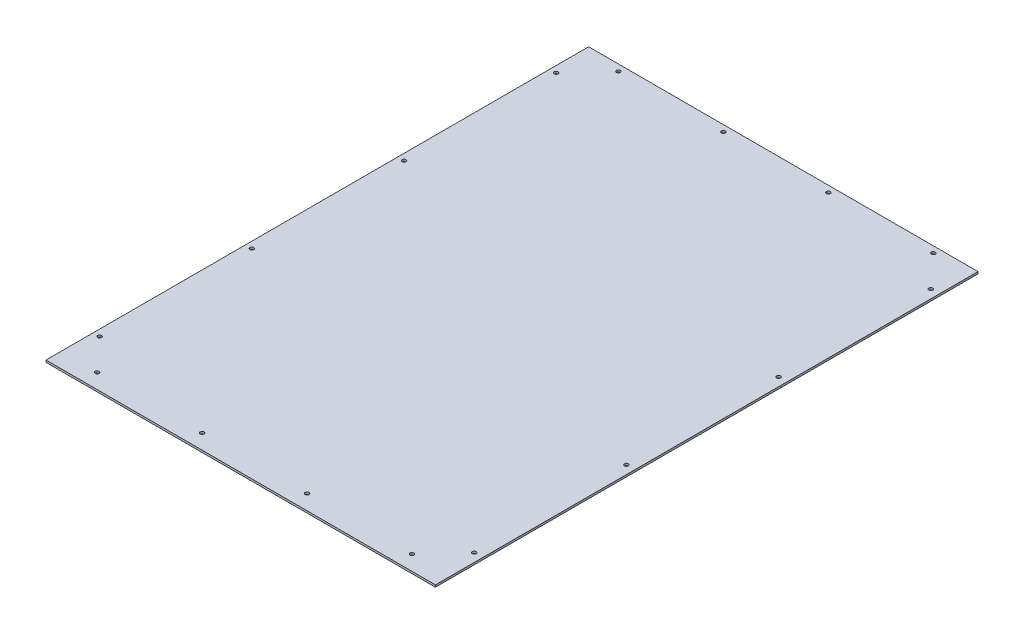
ISO-10303-21;
HEADER;
FILE_DESCRIPTION(('STEP AP214'),'2;1');
FILE_NAME('part.step','',(''),(''),'','','');
FILE_SCHEMA(('AUTOMOTIVE_DESIGN { 1 0 10303 214 1 1 1 1 }'));
ENDSEC;
DATA;
#1=APPLICATION_CONTEXT('core data for automotive mechanical design processes');
#2=APPLICATION_PROTOCOL_DEFINITION('international standard','automotive_design',2000,#1);
#3=PRODUCT_CONTEXT('',#1,'mechanical');
#4=PRODUCT('Part','Part','',(#3));
#5=PRODUCT_RELATED_PRODUCT_CATEGORY('part','',(#4));
#6=PRODUCT_DEFINITION_FORMATION('','',#4);
#7=PRODUCT_DEFINITION_CONTEXT('part definition',#1,'design');
#8=PRODUCT_DEFINITION('design','',#6,#7);
#9=PRODUCT_DEFINITION_SHAPE('','',#8);
#10=(LENGTH_UNIT() NAMED_UNIT(*) SI_UNIT(.MILLI.,.METRE.));
#11=(NAMED_UNIT(*) PLANE_ANGLE_UNIT() SI_UNIT($,.RADIAN.));
#12=(NAMED_UNIT(*) SI_UNIT($,.STERADIAN.) SOLID_ANGLE_UNIT());
#13=UNCERTAINTY_MEASURE_WITH_UNIT(LENGTH_MEASURE(1.E-05),#10,'distance_accuracy_value','');
#14=(GEOMETRIC_REPRESENTATION_CONTEXT(3) GLOBAL_UNCERTAINTY_ASSIGNED_CONTEXT((#13)) GLOBAL_UNIT_ASSIGNED_CONTEXT((#10,
#11,#12)) REPRESENTATION_CONTEXT('',''));
#15=CARTESIAN_POINT('',(0.,0.,0.));
#16=DIRECTION('',(0.,0.,1.));
#17=DIRECTION('',(1.,0.,0.));
#18=AXIS2_PLACEMENT_3D('',#15,#16,#17);
#19=CARTESIAN_POINT('',(9.525,0.,-70.5865999999999));
#20=DIRECTION('',(0.,1.,0.));
#21=DIRECTION('',(0.,0.,1.));
#22=AXIS2_PLACEMENT_3D('',#19,#20,#21);
#23=CYLINDRICAL_SURFACE('',#22,2.89559999999984);
#24=CARTESIAN_POINT('',(9.525,0.,-70.5865999999999));
#25=DIRECTION('',(0.,1.,0.));
#26=DIRECTION('',(0.,0.,1.));
#27=AXIS2_PLACEMENT_3D('',#24,#25,#26);
#28=CIRCLE('',#27,2.89559999999984);
#29=CARTESIAN_POINT('',(9.525,0.,-67.691));
#30=VERTEX_POINT('',#29);
#31=EDGE_CURVE('E44',#30,#30,#28,.T.);
#32=ORIENTED_EDGE('',*,*,#31,.F.);
#33=EDGE_LOOP('',(#32));
#34=FACE_BOUND('',#33,.T.);
#35=CARTESIAN_POINT('',(9.525,3.0734,-70.5865999999999));
#36=DIRECTION('',(0.,1.,0.));
#37=DIRECTION('',(0.,0.,1.));
#38=AXIS2_PLACEMENT_3D('',#35,#36,#37);
#39=CIRCLE('',#38,2.89559999999984);
#40=CARTESIAN_POINT('',(9.525,3.0734,-67.691));
#41=VERTEX_POINT('',#40);
#42=EDGE_CURVE('E12',#41,#41,#39,.T.);
#43=ORIENTED_EDGE('',*,*,#42,.T.);
#44=EDGE_LOOP('',(#43));
#45=FACE_BOUND('',#44,.T.);
#46=ADVANCED_FACE('F38',(#34,#45),#23,.F.);
#47=CARTESIAN_POINT('',(9.525,0.,-297.671066666666));
#48=DIRECTION('',(0.,1.,0.));
#49=DIRECTION('',(0.,0.,1.));
#50=AXIS2_PLACEMENT_3D('',#47,#48,#49);
#51=CYLINDRICAL_SURFACE('',#50,2.89559999999984);
#52=CARTESIAN_POINT('',(9.525,0.,-297.671066666666));
#53=DIRECTION('',(0.,1.,0.));
#54=DIRECTION('',(0.,0.,1.));
#55=AXIS2_PLACEMENT_3D('',#52,#53,#54);
#56=CIRCLE('',#55,2.89559999999984);
#57=CARTESIAN_POINT('',(9.525,0.,-294.775466666667));
#58=VERTEX_POINT('',#57);
#59=EDGE_CURVE('E344',#58,#58,#56,.T.);
#60=ORIENTED_EDGE('',*,*,#59,.F.);
#61=EDGE_LOOP('',(#60));
#62=FACE_BOUND('',#61,.T.);
#63=CARTESIAN_POINT('',(9.525,3.0734,-297.671066666666));
#64=DIRECTION('',(0.,1.,0.));
#65=DIRECTION('',(0.,0.,1.));
#66=AXIS2_PLACEMENT_3D('',#63,#64,#65);
#67=CIRCLE('',#66,2.89559999999984);
#68=CARTESIAN_POINT('',(9.525,3.0734,-294.775466666667));
#69=VERTEX_POINT('',#68);
#70=EDGE_CURVE('E349',#69,#69,#67,.T.);
#71=ORIENTED_EDGE('',*,*,#70,.T.);
#72=EDGE_LOOP('',(#71));
#73=FACE_BOUND('',#72,.T.);
#74=ADVANCED_FACE('F360',(#62,#73),#51,.F.);
#75=CARTESIAN_POINT('',(568.5282,0.,-70.5865999999999));
#76=DIRECTION('',(0.,1.,0.));
#77=DIRECTION('',(0.,0.,1.));
#78=AXIS2_PLACEMENT_3D('',#75,#76,#77);
#79=CYLINDRICAL_SURFACE('',#78,2.89559999999998);
#80=CARTESIAN_POINT('',(568.5282,0.,-70.5865999999999));
#81=DIRECTION('',(0.,1.,0.));
#82=DIRECTION('',(0.,0.,1.));
#83=AXIS2_PLACEMENT_3D('',#80,#81,#82);
#84=CIRCLE('',#83,2.89559999999998);
#85=CARTESIAN_POINT('',(568.5282,0.,-67.6909999999999));
#86=VERTEX_POINT('',#85);
#87=EDGE_CURVE('E337',#86,#86,#84,.T.);
#88=ORIENTED_EDGE('',*,*,#87,.F.);
#89=EDGE_LOOP('',(#88));
#90=FACE_BOUND('',#89,.T.);
#91=CARTESIAN_POINT('',(568.5282,3.0734,-70.5865999999999));
#92=DIRECTION('',(0.,1.,0.));
#93=DIRECTION('',(0.,0.,1.));
#94=AXIS2_PLACEMENT_3D('',#91,#92,#93);
#95=CIRCLE('',#94,2.89559999999998);
#96=CARTESIAN_POINT('',(568.5282,3.0734,-67.6909999999999));
#97=VERTEX_POINT('',#96);
#98=EDGE_CURVE('E342',#97,#97,#95,.T.);
#99=ORIENTED_EDGE('',*,*,#98,.T.);
#100=EDGE_LOOP('',(#99));
#101=FACE_BOUND('',#100,.T.);
#102=ADVANCED_FACE('F411',(#90,#101),#79,.F.);
#103=CARTESIAN_POINT('',(568.5282,0.,-297.671066666666));
#104=DIRECTION('',(0.,1.,0.));
#105=DIRECTION('',(0.,0.,1.));
#106=AXIS2_PLACEMENT_3D('',#103,#104,#105);
#107=CYLINDRICAL_SURFACE('',#106,2.89559999999998);
#108=CARTESIAN_POINT('',(568.5282,0.,-297.671066666666));
#109=DIRECTION('',(0.,1.,0.));
#110=DIRECTION('',(0.,0.,1.));
#111=AXIS2_PLACEMENT_3D('',#108,#109,#110);
#112=CIRCLE('',#111,2.89559999999998);
#113=CARTESIAN_POINT('',(568.5282,0.,-294.775466666666));
#114=VERTEX_POINT('',#113);
#115=EDGE_CURVE('E329',#114,#114,#112,.T.);
#116=ORIENTED_EDGE('',*,*,#115,.F.);
#117=EDGE_LOOP('',(#116));
#118=FACE_BOUND('',#117,.T.);
#119=CARTESIAN_POINT('',(568.5282,3.0734,-297.671066666666));
#120=DIRECTION('',(0.,1.,0.));
#121=DIRECTION('',(0.,0.,1.));
#122=AXIS2_PLACEMENT_3D('',#119,#120,#121);
#123=CIRCLE('',#122,2.89559999999998);
#124=CARTESIAN_POINT('',(568.5282,3.0734,-294.775466666666));
#125=VERTEX_POINT('',#124);
#126=EDGE_CURVE('E334',#125,#125,#123,.T.);
#127=ORIENTED_EDGE('',*,*,#126,.T.);
#128=EDGE_LOOP('',(#127));
#129=FACE_BOUND('',#128,.T.);
#130=ADVANCED_FACE('F407',(#118,#129),#107,.F.);
#131=CARTESIAN_POINT('',(523.9766,0.,-800.2016));
#132=DIRECTION('',(0.,1.,0.));
#133=DIRECTION('',(0.,0.,1.));
#134=AXIS2_PLACEMENT_3D('',#131,#132,#133);
#135=CYLINDRICAL_SURFACE('',#134,2.89559999999997);
#136=CARTESIAN_POINT('',(523.9766,0.,-800.2016));
#137=DIRECTION('',(0.,1.,0.));
#138=DIRECTION('',(0.,0.,1.));
#139=AXIS2_PLACEMENT_3D('',#136,#137,#138);
#140=CIRCLE('',#139,2.89559999999997);
#141=CARTESIAN_POINT('',(523.9766,0.,-797.306));
#142=VERTEX_POINT('',#141);
#143=EDGE_CURVE('E322',#142,#142,#140,.T.);
#144=ORIENTED_EDGE('',*,*,#143,.F.);
#145=EDGE_LOOP('',(#144));
#146=FACE_BOUND('',#145,.T.);
#147=CARTESIAN_POINT('',(523.9766,3.0734,-800.2016));
#148=DIRECTION('',(0.,1.,0.));
#149=DIRECTION('',(0.,0.,1.));
#150=AXIS2_PLACEMENT_3D('',#147,#148,#149);
#151=CIRCLE('',#150,2.89559999999997);
#152=CARTESIAN_POINT('',(523.9766,3.0734,-797.306));
#153=VERTEX_POINT('',#152);
#154=EDGE_CURVE('E327',#153,#153,#151,.T.);
#155=ORIENTED_EDGE('',*,*,#154,.T.);
#156=EDGE_LOOP('',(#155));
#157=FACE_BOUND('',#156,.T.);
#158=ADVANCED_FACE('F403',(#146,#157),#135,.F.);
#159=CARTESIAN_POINT('',(367.343266666667,0.,-800.2016));
#160=DIRECTION('',(0.,1.,0.));
#161=DIRECTION('',(0.,0.,1.));
#162=AXIS2_PLACEMENT_3D('',#159,#160,#161);
#163=CYLINDRICAL_SURFACE('',#162,2.89559999999997);
#164=CARTESIAN_POINT('',(367.343266666667,0.,-800.2016));
#165=DIRECTION('',(0.,1.,0.));
#166=DIRECTION('',(0.,0.,1.));
#167=AXIS2_PLACEMENT_3D('',#164,#165,#166);
#168=CIRCLE('',#167,2.89559999999997);
#169=CARTESIAN_POINT('',(367.343266666667,0.,-797.306));
#170=VERTEX_POINT('',#169);
#171=EDGE_CURVE('E311',#170,#170,#168,.T.);
#172=ORIENTED_EDGE('',*,*,#171,.F.);
#173=EDGE_LOOP('',(#172));
#174=FACE_BOUND('',#173,.T.);
#175=CARTESIAN_POINT('',(367.343266666667,3.0734,-800.2016));
#176=DIRECTION('',(0.,1.,0.));
#177=DIRECTION('',(0.,0.,1.));
#178=AXIS2_PLACEMENT_3D('',#175,#176,#177);
#179=CIRCLE('',#178,2.89559999999997);
#180=CARTESIAN_POINT('',(367.343266666667,3.0734,-797.306));
#181=VERTEX_POINT('',#180);
#182=EDGE_CURVE('E316',#181,#181,#179,.T.);
#183=ORIENTED_EDGE('',*,*,#182,.T.);
#184=EDGE_LOOP('',(#183));
#185=FACE_BOUND('',#184,.T.);
#186=ADVANCED_FACE('F399',(#174,#185),#163,.F.);
#187=CARTESIAN_POINT('',(523.9766,0.,-22.225));
#188=DIRECTION('',(0.,1.,0.));
#189=DIRECTION('',(0.,0.,1.));
#190=AXIS2_PLACEMENT_3D('',#187,#188,#189);
#191=CYLINDRICAL_SURFACE('',#190,2.89559999999999);
#192=CARTESIAN_POINT('',(523.9766,0.,-22.225));
#193=DIRECTION('',(0.,1.,0.));
#194=DIRECTION('',(0.,0.,1.));
#195=AXIS2_PLACEMENT_3D('',#192,#193,#194);
#196=CIRCLE('',#195,2.89559999999999);
#197=CARTESIAN_POINT('',(523.9766,0.,-19.3294));
#198=VERTEX_POINT('',#197);
#199=EDGE_CURVE('E303',#198,#198,#196,.T.);
#200=ORIENTED_EDGE('',*,*,#199,.F.);
#201=EDGE_LOOP('',(#200));
#202=FACE_BOUND('',#201,.T.);
#203=CARTESIAN_POINT('',(523.9766,3.0734,-22.225));
#204=DIRECTION('',(0.,1.,0.));
#205=DIRECTION('',(0.,0.,1.));
#206=AXIS2_PLACEMENT_3D('',#203,#204,#205);
#207=CIRCLE('',#206,2.89559999999999);
#208=CARTESIAN_POINT('',(523.9766,3.0734,-19.3294));
#209=VERTEX_POINT('',#208);
#210=EDGE_CURVE('E308',#209,#209,#207,.T.);
#211=ORIENTED_EDGE('',*,*,#210,.T.);
#212=EDGE_LOOP('',(#211));
#213=FACE_BOUND('',#212,.T.);
#214=ADVANCED_FACE('F395',(#202,#213),#191,.F.);
#215=CARTESIAN_POINT('',(367.343266666667,0.,-22.225));
#216=DIRECTION('',(0.,1.,0.));
#217=DIRECTION('',(0.,0.,1.));
#218=AXIS2_PLACEMENT_3D('',#215,#216,#217);
#219=CYLINDRICAL_SURFACE('',#218,2.89559999999999);
#220=CARTESIAN_POINT('',(367.343266666667,0.,-22.225));
#221=DIRECTION('',(0.,1.,0.));
#222=DIRECTION('',(0.,0.,1.));
#223=AXIS2_PLACEMENT_3D('',#220,#221,#222);
#224=CIRCLE('',#223,2.89559999999999);
#225=CARTESIAN_POINT('',(367.343266666667,0.,-19.3294));
#226=VERTEX_POINT('',#225);
#227=EDGE_CURVE('E293',#226,#226,#224,.T.);
#228=ORIENTED_EDGE('',*,*,#227,.F.);
#229=EDGE_LOOP('',(#228));
#230=FACE_BOUND('',#229,.T.);
#231=CARTESIAN_POINT('',(367.343266666667,3.0734,-22.225));
#232=DIRECTION('',(0.,1.,0.));
#233=DIRECTION('',(0.,0.,1.));
#234=AXIS2_PLACEMENT_3D('',#231,#232,#233);
#235=CIRCLE('',#234,2.89559999999999);
#236=CARTESIAN_POINT('',(367.343266666667,3.0734,-19.3294));
#237=VERTEX_POINT('',#236);
#238=EDGE_CURVE('E299',#237,#237,#235,.T.);
#239=ORIENTED_EDGE('',*,*,#238,.T.);
#240=EDGE_LOOP('',(#239));
#241=FACE_BOUND('',#240,.T.);
#242=ADVANCED_FACE('F391',(#230,#241),#219,.F.);
#243=CARTESIAN_POINT('',(0.,3.0734,0.));
#244=DIRECTION('',(1.,0.,0.));
#245=DIRECTION('',(0.,0.,-1.));
#246=AXIS2_PLACEMENT_3D('',#243,#244,#245);
#247=PLANE('',#246);
#248=DIRECTION('',(0.,0.,1.));
#249=VECTOR('',#248,1.);
#250=CARTESIAN_POINT('',(0.,0.,0.));
#251=LINE('',#250,#249);
#252=CARTESIAN_POINT('',(0.,0.,-809.7266));
#253=VERTEX_POINT('',#252);
#254=CARTESIAN_POINT('',(0.,0.,0.));
#255=VERTEX_POINT('',#254);
#256=EDGE_CURVE('E266',#253,#255,#251,.T.);
#257=ORIENTED_EDGE('',*,*,#256,.T.);
#258=DIRECTION('',(0.,-1.,0.));
#259=VECTOR('',#258,1.);
#260=CARTESIAN_POINT('',(0.,3.0734,0.));
#261=LINE('',#260,#259);
#262=CARTESIAN_POINT('',(0.,3.0734,0.));
#263=VERTEX_POINT('',#262);
#264=EDGE_CURVE('E300',#263,#255,#261,.T.);
#265=ORIENTED_EDGE('',*,*,#264,.F.);
#266=DIRECTION('',(0.,0.,1.));
#267=VECTOR('',#266,1.);
#268=CARTESIAN_POINT('',(0.,3.0734,0.));
#269=LINE('',#268,#267);
#270=CARTESIAN_POINT('',(0.,3.0734,-809.7266));
#271=VERTEX_POINT('',#270);
#272=EDGE_CURVE('E269',#271,#263,#269,.T.);
#273=ORIENTED_EDGE('',*,*,#272,.F.);
#274=DIRECTION('',(0.,-1.,0.));
#275=VECTOR('',#274,1.);
#276=CARTESIAN_POINT('',(0.,3.0734,-809.7266));
#277=LINE('',#276,#275);
#278=EDGE_CURVE('E274',#271,#253,#277,.T.);
#279=ORIENTED_EDGE('',*,*,#278,.T.);
#280=EDGE_LOOP('',(#257,#265,#273,#279));
#281=FACE_BOUND('',#280,.T.);
#282=ADVANCED_FACE('F388',(#281),#247,.F.);
#283=CARTESIAN_POINT('',(581.1266,3.0734,0.));
#284=DIRECTION('',(0.,0.,-1.));
#285=DIRECTION('',(-1.,0.,0.));
#286=AXIS2_PLACEMENT_3D('',#283,#284,#285);
#287=PLANE('',#286);
#288=DIRECTION('',(1.,0.,0.));
#289=VECTOR('',#288,1.);
#290=CARTESIAN_POINT('',(581.1266,0.,0.));
#291=LINE('',#290,#289);
#292=CARTESIAN_POINT('',(581.1266,0.,0.));
#293=VERTEX_POINT('',#292);
#294=EDGE_CURVE('E279',#255,#293,#291,.T.);
#295=ORIENTED_EDGE('',*,*,#294,.T.);
#296=DIRECTION('',(0.,-1.,0.));
#297=VECTOR('',#296,1.);
#298=CARTESIAN_POINT('',(581.1266,3.0734,0.));
#299=LINE('',#298,#297);
#300=CARTESIAN_POINT('',(581.1266,3.0734,0.));
#301=VERTEX_POINT('',#300);
#302=EDGE_CURVE('E674',#301,#293,#299,.T.);
#303=ORIENTED_EDGE('',*,*,#302,.F.);
#304=DIRECTION('',(1.,0.,0.));
#305=VECTOR('',#304,1.);
#306=CARTESIAN_POINT('',(581.1266,3.0734,0.));
#307=LINE('',#306,#305);
#308=EDGE_CURVE('E89',#263,#301,#307,.T.);
#309=ORIENTED_EDGE('',*,*,#308,.F.);
#310=ORIENTED_EDGE('',*,*,#264,.T.);
#311=EDGE_LOOP('',(#295,#303,#309,#310));
#312=FACE_BOUND('',#311,.T.);
#313=ADVANCED_FACE('F384',(#312),#287,.F.);
#314=CARTESIAN_POINT('',(581.1266,3.0734,0.));
#315=DIRECTION('',(-1.,0.,0.));
#316=DIRECTION('',(0.,0.,1.));
#317=AXIS2_PLACEMENT_3D('',#314,#315,#316);
#318=PLANE('',#317);
#319=DIRECTION('',(0.,0.,-1.));
#320=VECTOR('',#319,1.);
#321=CARTESIAN_POINT('',(581.1266,0.,0.));
#322=LINE('',#321,#320);
#323=CARTESIAN_POINT('',(581.1266,0.,-809.7266));
#324=VERTEX_POINT('',#323);
#325=EDGE_CURVE('E283',#293,#324,#322,.T.);
#326=ORIENTED_EDGE('',*,*,#325,.T.);
#327=DIRECTION('',(0.,-1.,0.));
#328=VECTOR('',#327,1.);
#329=CARTESIAN_POINT('',(581.1266,3.0734,-809.7266));
#330=LINE('',#329,#328);
#331=CARTESIAN_POINT('',(581.1266,3.0734,-809.7266));
#332=VERTEX_POINT('',#331);
#333=EDGE_CURVE('E673',#332,#324,#330,.T.);
#334=ORIENTED_EDGE('',*,*,#333,.F.);
#335=DIRECTION('',(0.,0.,-1.));
#336=VECTOR('',#335,1.);
#337=CARTESIAN_POINT('',(581.1266,3.0734,0.));
#338=LINE('',#337,#336);
#339=EDGE_CURVE('E272',#301,#332,#338,.T.);
#340=ORIENTED_EDGE('',*,*,#339,.F.);
#341=ORIENTED_EDGE('',*,*,#302,.T.);
#342=EDGE_LOOP('',(#326,#334,#340,#341));
#343=FACE_BOUND('',#342,.T.);
#344=ADVANCED_FACE('F375',(#343),#318,.F.);
#345=CARTESIAN_POINT('',(581.1266,3.0734,-809.7266));
#346=DIRECTION('',(0.,0.,1.));
#347=DIRECTION('',(1.,0.,0.));
#348=AXIS2_PLACEMENT_3D('',#345,#346,#347);
#349=PLANE('',#348);
#350=DIRECTION('',(-1.,0.,0.));
#351=VECTOR('',#350,1.);
#352=CARTESIAN_POINT('',(581.1266,0.,-809.7266));
#353=LINE('',#352,#351);
#354=EDGE_CURVE('E81',#324,#253,#353,.T.);
#355=ORIENTED_EDGE('',*,*,#354,.T.);
#356=ORIENTED_EDGE('',*,*,#278,.F.);
#357=DIRECTION('',(-1.,0.,0.));
#358=VECTOR('',#357,1.);
#359=CARTESIAN_POINT('',(581.1266,3.0734,-809.7266));
#360=LINE('',#359,#358);
#361=EDGE_CURVE('E60',#332,#271,#360,.T.);
#362=ORIENTED_EDGE('',*,*,#361,.F.);
#363=ORIENTED_EDGE('',*,*,#333,.T.);
#364=EDGE_LOOP('',(#355,#356,#362,#363));
#365=FACE_BOUND('',#364,.T.);
#366=ADVANCED_FACE('F365',(#365),#349,.F.);
#367=CARTESIAN_POINT('',(0.,3.0734,0.));
#368=DIRECTION('',(0.,1.,0.));
#369=DIRECTION('',(0.,0.,1.));
#370=AXIS2_PLACEMENT_3D('',#367,#368,#369);
#371=PLANE('',#370);
#372=CARTESIAN_POINT('',(9.525,3.0734,-524.755533333333));
#373=DIRECTION('',(0.,1.,0.));
#374=DIRECTION('',(0.,0.,1.));
#375=AXIS2_PLACEMENT_3D('',#372,#373,#374);
#376=CIRCLE('',#375,2.89559999999984);
#377=CARTESIAN_POINT('',(9.525,3.0734,-521.859933333333));
#378=VERTEX_POINT('',#377);
#379=EDGE_CURVE('E199',#378,#378,#376,.T.);
#380=ORIENTED_EDGE('',*,*,#379,.F.);
#381=EDGE_LOOP('',(#380));
#382=FACE_BOUND('',#381,.T.);
#383=CARTESIAN_POINT('',(568.5282,3.0734,-524.755533333333));
#384=DIRECTION('',(0.,1.,0.));
#385=DIRECTION('',(0.,0.,1.));
#386=AXIS2_PLACEMENT_3D('',#383,#384,#385);
#387=CIRCLE('',#386,2.89559999999998);
#388=CARTESIAN_POINT('',(568.5282,3.0734,-521.859933333333));
#389=VERTEX_POINT('',#388);
#390=EDGE_CURVE('E213',#389,#389,#387,.T.);
#391=ORIENTED_EDGE('',*,*,#390,.F.);
#392=EDGE_LOOP('',(#391));
#393=FACE_BOUND('',#392,.T.);
#394=CARTESIAN_POINT('',(210.709933333333,3.0734,-800.2016));
#395=DIRECTION('',(0.,1.,0.));
#396=DIRECTION('',(0.,0.,1.));
#397=AXIS2_PLACEMENT_3D('',#394,#395,#396);
#398=CIRCLE('',#397,2.89559999999997);
#399=CARTESIAN_POINT('',(210.709933333333,3.0734,-797.306));
#400=VERTEX_POINT('',#399);
#401=EDGE_CURVE('E220',#400,#400,#398,.T.);
#402=ORIENTED_EDGE('',*,*,#401,.F.);
#403=EDGE_LOOP('',(#402));
#404=FACE_BOUND('',#403,.T.);
#405=CARTESIAN_POINT('',(210.709933333333,3.0734,-22.225));
#406=DIRECTION('',(0.,1.,0.));
#407=DIRECTION('',(0.,0.,1.));
#408=AXIS2_PLACEMENT_3D('',#405,#406,#407);
#409=CIRCLE('',#408,2.89559999999999);
#410=CARTESIAN_POINT('',(210.709933333333,3.0734,-19.3294));
#411=VERTEX_POINT('',#410);
#412=EDGE_CURVE('E228',#411,#411,#409,.T.);
#413=ORIENTED_EDGE('',*,*,#412,.F.);
#414=EDGE_LOOP('',(#413));
#415=FACE_BOUND('',#414,.T.);
#416=CARTESIAN_POINT('',(568.5282,3.0734,-751.84));
#417=DIRECTION('',(0.,1.,0.));
#418=DIRECTION('',(0.,0.,1.));
#419=AXIS2_PLACEMENT_3D('',#416,#417,#418);
#420=CIRCLE('',#419,2.89559999999998);
#421=CARTESIAN_POINT('',(568.5282,3.0734,-748.9444));
#422=VERTEX_POINT('',#421);
#423=EDGE_CURVE('E240',#422,#422,#420,.T.);
#424=ORIENTED_EDGE('',*,*,#423,.F.);
#425=EDGE_LOOP('',(#424));
#426=FACE_BOUND('',#425,.T.);
#427=CARTESIAN_POINT('',(9.525,3.0734,-751.84));
#428=DIRECTION('',(0.,1.,0.));
#429=DIRECTION('',(0.,0.,1.));
#430=AXIS2_PLACEMENT_3D('',#427,#428,#429);
#431=CIRCLE('',#430,2.89559999999984);
#432=CARTESIAN_POINT('',(9.525,3.0734,-748.9444));
#433=VERTEX_POINT('',#432);
#434=EDGE_CURVE('E239',#433,#433,#431,.T.);
#435=ORIENTED_EDGE('',*,*,#434,.F.);
#436=EDGE_LOOP('',(#435));
#437=FACE_BOUND('',#436,.T.);
#438=CARTESIAN_POINT('',(54.0766,3.0734,-22.225));
#439=DIRECTION('',(0.,1.,0.));
#440=DIRECTION('',(0.,0.,1.));
#441=AXIS2_PLACEMENT_3D('',#438,#439,#440);
#442=CIRCLE('',#441,2.89559999999999);
#443=CARTESIAN_POINT('',(54.0766,3.0734,-19.3294));
#444=VERTEX_POINT('',#443);
#445=EDGE_CURVE('E247',#444,#444,#442,.T.);
#446=ORIENTED_EDGE('',*,*,#445,.F.);
#447=EDGE_LOOP('',(#446));
#448=FACE_BOUND('',#447,.T.);
#449=CARTESIAN_POINT('',(54.0765999999999,3.0734,-800.2016));
#450=DIRECTION('',(0.,1.,0.));
#451=DIRECTION('',(0.,0.,1.));
#452=AXIS2_PLACEMENT_3D('',#449,#450,#451);
#453=CIRCLE('',#452,2.89559999999997);
#454=CARTESIAN_POINT('',(54.0765999999999,3.0734,-797.306));
#455=VERTEX_POINT('',#454);
#456=EDGE_CURVE('E255',#455,#455,#453,.T.);
#457=ORIENTED_EDGE('',*,*,#456,.F.);
#458=EDGE_LOOP('',(#457));
#459=FACE_BOUND('',#458,.T.);
#460=ORIENTED_EDGE('',*,*,#272,.T.);
#461=ORIENTED_EDGE('',*,*,#308,.T.);
#462=ORIENTED_EDGE('',*,*,#339,.T.);
#463=ORIENTED_EDGE('',*,*,#361,.T.);
#464=EDGE_LOOP('',(#460,#461,#462,#463));
#465=FACE_BOUND('',#464,.T.);
#466=ORIENTED_EDGE('',*,*,#238,.F.);
#467=EDGE_LOOP('',(#466));
#468=FACE_BOUND('',#467,.T.);
#469=ORIENTED_EDGE('',*,*,#210,.F.);
#470=EDGE_LOOP('',(#469));
#471=FACE_BOUND('',#470,.T.);
#472=ORIENTED_EDGE('',*,*,#182,.F.);
#473=EDGE_LOOP('',(#472));
#474=FACE_BOUND('',#473,.T.);
#475=ORIENTED_EDGE('',*,*,#154,.F.);
#476=EDGE_LOOP('',(#475));
#477=FACE_BOUND('',#476,.T.);
#478=ORIENTED_EDGE('',*,*,#126,.F.);
#479=EDGE_LOOP('',(#478));
#480=FACE_BOUND('',#479,.T.);
#481=ORIENTED_EDGE('',*,*,#98,.F.);
#482=EDGE_LOOP('',(#481));
#483=FACE_BOUND('',#482,.T.);
#484=ORIENTED_EDGE('',*,*,#70,.F.);
#485=EDGE_LOOP('',(#484));
#486=FACE_BOUND('',#485,.T.);
#487=ORIENTED_EDGE('',*,*,#42,.F.);
#488=EDGE_LOOP('',(#487));
#489=FACE_BOUND('',#488,.T.);
#490=ADVANCED_FACE('F363',(#382,#393,#404,#415,#426,#437,#448,#459,#465,#468,#471,#474,#477,
#480,#483,#486,#489),#371,.T.);
#491=CARTESIAN_POINT('',(0.,0.,0.));
#492=DIRECTION('',(0.,1.,0.));
#493=DIRECTION('',(0.,0.,1.));
#494=AXIS2_PLACEMENT_3D('',#491,#492,#493);
#495=PLANE('',#494);
#496=DIRECTION('',(-1.,0.,0.));
#497=VECTOR('',#496,1.);
#498=CARTESIAN_POINT('',(10.033,0.,-19.3294));
#499=LINE('',#498,#497);
#500=CARTESIAN_POINT('',(10.033,0.,-19.3294));
#501=VERTEX_POINT('',#500);
#502=CARTESIAN_POINT('',(9.017,0.,-19.3294));
#503=VERTEX_POINT('',#502);
#504=EDGE_CURVE('E170',#501,#503,#499,.T.);
#505=ORIENTED_EDGE('',*,*,#504,.F.);
#506=DIRECTION('',(0.,0.,1.));
#507=VECTOR('',#506,1.);
#508=CARTESIAN_POINT('',(10.033,0.,-19.3294));
#509=LINE('',#508,#507);
#510=CARTESIAN_POINT('',(10.033,0.,-20.5994));
#511=VERTEX_POINT('',#510);
#512=EDGE_CURVE('E51',#511,#501,#509,.T.);
#513=ORIENTED_EDGE('',*,*,#512,.F.);
#514=DIRECTION('',(-1.,0.,0.));
#515=VECTOR('',#514,1.);
#516=CARTESIAN_POINT('',(10.033,0.,-20.5994));
#517=LINE('',#516,#515);
#518=CARTESIAN_POINT('',(10.541,0.,-20.5994));
#519=VERTEX_POINT('',#518);
#520=EDGE_CURVE('E150',#519,#511,#517,.T.);
#521=ORIENTED_EDGE('',*,*,#520,.F.);
#522=DIRECTION('',(0.624695047554424,0.,0.78086880944303));
#523=VECTOR('',#522,1.);
#524=CARTESIAN_POINT('',(10.541,0.,-20.5994));
#525=LINE('',#524,#523);
#526=CARTESIAN_POINT('',(9.525,0.,-21.8694));
#527=VERTEX_POINT('',#526);
#528=EDGE_CURVE('E154',#527,#519,#525,.T.);
#529=ORIENTED_EDGE('',*,*,#528,.F.);
#530=DIRECTION('',(0.624695047554424,0.,-0.78086880944303));
#531=VECTOR('',#530,1.);
#532=CARTESIAN_POINT('',(8.509,0.,-20.5994));
#533=LINE('',#532,#531);
#534=CARTESIAN_POINT('',(8.509,0.,-20.5994));
#535=VERTEX_POINT('',#534);
#536=EDGE_CURVE('E654',#535,#527,#533,.T.);
#537=ORIENTED_EDGE('',*,*,#536,.F.);
#538=DIRECTION('',(-1.,0.,0.));
#539=VECTOR('',#538,1.);
#540=CARTESIAN_POINT('',(9.017,0.,-20.5994));
#541=LINE('',#540,#539);
#542=CARTESIAN_POINT('',(9.017,0.,-20.5994));
#543=VERTEX_POINT('',#542);
#544=EDGE_CURVE('E648',#543,#535,#541,.T.);
#545=ORIENTED_EDGE('',*,*,#544,.F.);
#546=DIRECTION('',(0.,0.,-1.));
#547=VECTOR('',#546,1.);
#548=CARTESIAN_POINT('',(9.017,0.,-19.3294));
#549=LINE('',#548,#547);
#550=EDGE_CURVE('E644',#503,#543,#549,.T.);
#551=ORIENTED_EDGE('',*,*,#550,.F.);
#552=EDGE_LOOP('',(#505,#513,#521,#529,#537,#545,#551));
#553=FACE_BOUND('',#552,.T.);
#554=CARTESIAN_POINT('',(9.525,0.,-524.755533333333));
#555=DIRECTION('',(0.,1.,0.));
#556=DIRECTION('',(0.,0.,1.));
#557=AXIS2_PLACEMENT_3D('',#554,#555,#556);
#558=CIRCLE('',#557,2.89559999999984);
#559=CARTESIAN_POINT('',(9.525,0.,-521.859933333333));
#560=VERTEX_POINT('',#559);
#561=EDGE_CURVE('E185',#560,#560,#558,.T.);
#562=ORIENTED_EDGE('',*,*,#561,.T.);
#563=EDGE_LOOP('',(#562));
#564=FACE_BOUND('',#563,.T.);
#565=CARTESIAN_POINT('',(568.5282,0.,-524.755533333333));
#566=DIRECTION('',(0.,1.,0.));
#567=DIRECTION('',(0.,0.,1.));
#568=AXIS2_PLACEMENT_3D('',#565,#566,#567);
#569=CIRCLE('',#568,2.89559999999998);
#570=CARTESIAN_POINT('',(568.5282,0.,-521.859933333333));
#571=VERTEX_POINT('',#570);
#572=EDGE_CURVE('E208',#571,#571,#569,.T.);
#573=ORIENTED_EDGE('',*,*,#572,.T.);
#574=EDGE_LOOP('',(#573));
#575=FACE_BOUND('',#574,.T.);
#576=CARTESIAN_POINT('',(210.709933333333,0.,-800.2016));
#577=DIRECTION('',(0.,1.,0.));
#578=DIRECTION('',(0.,0.,1.));
#579=AXIS2_PLACEMENT_3D('',#576,#577,#578);
#580=CIRCLE('',#579,2.89559999999997);
#581=CARTESIAN_POINT('',(210.709933333333,0.,-797.306));
#582=VERTEX_POINT('',#581);
#583=EDGE_CURVE('E215',#582,#582,#580,.T.);
#584=ORIENTED_EDGE('',*,*,#583,.T.);
#585=EDGE_LOOP('',(#584));
#586=FACE_BOUND('',#585,.T.);
#587=CARTESIAN_POINT('',(210.709933333333,0.,-22.225));
#588=DIRECTION('',(0.,1.,0.));
#589=DIRECTION('',(0.,0.,1.));
#590=AXIS2_PLACEMENT_3D('',#587,#588,#589);
#591=CIRCLE('',#590,2.89559999999999);
#592=CARTESIAN_POINT('',(210.709933333333,0.,-19.3294));
#593=VERTEX_POINT('',#592);
#594=EDGE_CURVE('E223',#593,#593,#591,.T.);
#595=ORIENTED_EDGE('',*,*,#594,.T.);
#596=EDGE_LOOP('',(#595));
#597=FACE_BOUND('',#596,.T.);
#598=CARTESIAN_POINT('',(568.5282,0.,-751.84));
#599=DIRECTION('',(0.,1.,0.));
#600=DIRECTION('',(0.,0.,1.));
#601=AXIS2_PLACEMENT_3D('',#598,#599,#600);
#602=CIRCLE('',#601,2.89559999999998);
#603=CARTESIAN_POINT('',(568.5282,0.,-748.9444));
#604=VERTEX_POINT('',#603);
#605=EDGE_CURVE('E234',#604,#604,#602,.T.);
#606=ORIENTED_EDGE('',*,*,#605,.T.);
#607=EDGE_LOOP('',(#606));
#608=FACE_BOUND('',#607,.T.);
#609=CARTESIAN_POINT('',(9.525,0.,-751.84));
#610=DIRECTION('',(0.,1.,0.));
#611=DIRECTION('',(0.,0.,1.));
#612=AXIS2_PLACEMENT_3D('',#609,#610,#611);
#613=CIRCLE('',#612,2.89559999999984);
#614=CARTESIAN_POINT('',(9.525,0.,-748.9444));
#615=VERTEX_POINT('',#614);
#616=EDGE_CURVE('E242',#615,#615,#613,.T.);
#617=ORIENTED_EDGE('',*,*,#616,.T.);
#618=EDGE_LOOP('',(#617));
#619=FACE_BOUND('',#618,.T.);
#620=CARTESIAN_POINT('',(54.0766,0.,-22.225));
#621=DIRECTION('',(0.,1.,0.));
#622=DIRECTION('',(0.,0.,1.));
#623=AXIS2_PLACEMENT_3D('',#620,#621,#622);
#624=CIRCLE('',#623,2.89559999999999);
#625=CARTESIAN_POINT('',(54.0766,0.,-19.3294));
#626=VERTEX_POINT('',#625);
#627=EDGE_CURVE('E250',#626,#626,#624,.T.);
#628=ORIENTED_EDGE('',*,*,#627,.T.);
#629=EDGE_LOOP('',(#628));
#630=FACE_BOUND('',#629,.T.);
#631=CARTESIAN_POINT('',(54.0765999999999,0.,-800.2016));
#632=DIRECTION('',(0.,1.,0.));
#633=DIRECTION('',(0.,0.,1.));
#634=AXIS2_PLACEMENT_3D('',#631,#632,#633);
#635=CIRCLE('',#634,2.89559999999997);
#636=CARTESIAN_POINT('',(54.0765999999999,0.,-797.306));
#637=VERTEX_POINT('',#636);
#638=EDGE_CURVE('E261',#637,#637,#635,.T.);
#639=ORIENTED_EDGE('',*,*,#638,.T.);
#640=EDGE_LOOP('',(#639));
#641=FACE_BOUND('',#640,.T.);
#642=ORIENTED_EDGE('',*,*,#256,.F.);
#643=ORIENTED_EDGE('',*,*,#354,.F.);
#644=ORIENTED_EDGE('',*,*,#325,.F.);
#645=ORIENTED_EDGE('',*,*,#294,.F.);
#646=EDGE_LOOP('',(#642,#643,#644,#645));
#647=FACE_BOUND('',#646,.T.);
#648=ORIENTED_EDGE('',*,*,#227,.T.);
#649=EDGE_LOOP('',(#648));
#650=FACE_BOUND('',#649,.T.);
#651=ORIENTED_EDGE('',*,*,#199,.T.);
#652=EDGE_LOOP('',(#651));
#653=FACE_BOUND('',#652,.T.);
#654=ORIENTED_EDGE('',*,*,#171,.T.);
#655=EDGE_LOOP('',(#654));
#656=FACE_BOUND('',#655,.T.);
#657=ORIENTED_EDGE('',*,*,#143,.T.);
#658=EDGE_LOOP('',(#657));
#659=FACE_BOUND('',#658,.T.);
#660=ORIENTED_EDGE('',*,*,#115,.T.);
#661=EDGE_LOOP('',(#660));
#662=FACE_BOUND('',#661,.T.);
#663=ORIENTED_EDGE('',*,*,#87,.T.);
#664=EDGE_LOOP('',(#663));
#665=FACE_BOUND('',#664,.T.);
#666=ORIENTED_EDGE('',*,*,#59,.T.);
#667=EDGE_LOOP('',(#666));
#668=FACE_BOUND('',#667,.T.);
#669=ORIENTED_EDGE('',*,*,#31,.T.);
#670=EDGE_LOOP('',(#669));
#671=FACE_BOUND('',#670,.T.);
#672=ADVANCED_FACE('F356',(#553,#564,#575,#586,#597,#608,#619,#630,#641,#647,#650,#653,#656,
#659,#662,#665,#668,#671),#495,.F.);
#673=CARTESIAN_POINT('',(54.0765999999999,0.,-800.2016));
#674=DIRECTION('',(0.,1.,0.));
#675=DIRECTION('',(0.,0.,1.));
#676=AXIS2_PLACEMENT_3D('',#673,#674,#675);
#677=CYLINDRICAL_SURFACE('',#676,2.89559999999997);
#678=ORIENTED_EDGE('',*,*,#638,.F.);
#679=EDGE_LOOP('',(#678));
#680=FACE_BOUND('',#679,.T.);
#681=ORIENTED_EDGE('',*,*,#456,.T.);
#682=EDGE_LOOP('',(#681));
#683=FACE_BOUND('',#682,.T.);
#684=ADVANCED_FACE('F372',(#680,#683),#677,.F.);
#685=CARTESIAN_POINT('',(54.0766,0.,-22.225));
#686=DIRECTION('',(0.,1.,0.));
#687=DIRECTION('',(0.,0.,1.));
#688=AXIS2_PLACEMENT_3D('',#685,#686,#687);
#689=CYLINDRICAL_SURFACE('',#688,2.89559999999999);
#690=ORIENTED_EDGE('',*,*,#627,.F.);
#691=EDGE_LOOP('',(#690));
#692=FACE_BOUND('',#691,.T.);
#693=ORIENTED_EDGE('',*,*,#445,.T.);
#694=EDGE_LOOP('',(#693));
#695=FACE_BOUND('',#694,.T.);
#696=ADVANCED_FACE('F478',(#692,#695),#689,.F.);
#697=CARTESIAN_POINT('',(9.525,0.,-751.84));
#698=DIRECTION('',(0.,1.,0.));
#699=DIRECTION('',(0.,0.,1.));
#700=AXIS2_PLACEMENT_3D('',#697,#698,#699);
#701=CYLINDRICAL_SURFACE('',#700,2.89559999999984);
#702=ORIENTED_EDGE('',*,*,#616,.F.);
#703=EDGE_LOOP('',(#702));
#704=FACE_BOUND('',#703,.T.);
#705=ORIENTED_EDGE('',*,*,#434,.T.);
#706=EDGE_LOOP('',(#705));
#707=FACE_BOUND('',#706,.T.);
#708=ADVANCED_FACE('F488',(#704,#707),#701,.F.);
#709=CARTESIAN_POINT('',(568.5282,0.,-751.84));
#710=DIRECTION('',(0.,1.,0.));
#711=DIRECTION('',(0.,0.,1.));
#712=AXIS2_PLACEMENT_3D('',#709,#710,#711);
#713=CYLINDRICAL_SURFACE('',#712,2.89559999999998);
#714=ORIENTED_EDGE('',*,*,#605,.F.);
#715=EDGE_LOOP('',(#714));
#716=FACE_BOUND('',#715,.T.);
#717=ORIENTED_EDGE('',*,*,#423,.T.);
#718=EDGE_LOOP('',(#717));
#719=FACE_BOUND('',#718,.T.);
#720=ADVANCED_FACE('F496',(#716,#719),#713,.F.);
#721=CARTESIAN_POINT('',(210.709933333333,0.,-22.225));
#722=DIRECTION('',(0.,1.,0.));
#723=DIRECTION('',(0.,0.,1.));
#724=AXIS2_PLACEMENT_3D('',#721,#722,#723);
#725=CYLINDRICAL_SURFACE('',#724,2.89559999999999);
#726=ORIENTED_EDGE('',*,*,#594,.F.);
#727=EDGE_LOOP('',(#726));
#728=FACE_BOUND('',#727,.T.);
#729=ORIENTED_EDGE('',*,*,#412,.T.);
#730=EDGE_LOOP('',(#729));
#731=FACE_BOUND('',#730,.T.);
#732=ADVANCED_FACE('F505',(#728,#731),#725,.F.);
#733=CARTESIAN_POINT('',(210.709933333333,0.,-800.2016));
#734=DIRECTION('',(0.,1.,0.));
#735=DIRECTION('',(0.,0.,1.));
#736=AXIS2_PLACEMENT_3D('',#733,#734,#735);
#737=CYLINDRICAL_SURFACE('',#736,2.89559999999997);
#738=ORIENTED_EDGE('',*,*,#583,.F.);
#739=EDGE_LOOP('',(#738));
#740=FACE_BOUND('',#739,.T.);
#741=ORIENTED_EDGE('',*,*,#401,.T.);
#742=EDGE_LOOP('',(#741));
#743=FACE_BOUND('',#742,.T.);
#744=ADVANCED_FACE('F514',(#740,#743),#737,.F.);
#745=CARTESIAN_POINT('',(568.5282,0.,-524.755533333333));
#746=DIRECTION('',(0.,1.,0.));
#747=DIRECTION('',(0.,0.,1.));
#748=AXIS2_PLACEMENT_3D('',#745,#746,#747);
#749=CYLINDRICAL_SURFACE('',#748,2.89559999999998);
#750=ORIENTED_EDGE('',*,*,#572,.F.);
#751=EDGE_LOOP('',(#750));
#752=FACE_BOUND('',#751,.T.);
#753=ORIENTED_EDGE('',*,*,#390,.T.);
#754=EDGE_LOOP('',(#753));
#755=FACE_BOUND('',#754,.T.);
#756=ADVANCED_FACE('F522',(#752,#755),#749,.F.);
#757=CARTESIAN_POINT('',(9.525,0.,-524.755533333333));
#758=DIRECTION('',(0.,1.,0.));
#759=DIRECTION('',(0.,0.,1.));
#760=AXIS2_PLACEMENT_3D('',#757,#758,#759);
#761=CYLINDRICAL_SURFACE('',#760,2.89559999999984);
#762=ORIENTED_EDGE('',*,*,#561,.F.);
#763=EDGE_LOOP('',(#762));
#764=FACE_BOUND('',#763,.T.);
#765=ORIENTED_EDGE('',*,*,#379,.T.);
#766=EDGE_LOOP('',(#765));
#767=FACE_BOUND('',#766,.T.);
#768=ADVANCED_FACE('F530',(#764,#767),#761,.F.);
#769=CARTESIAN_POINT('',(10.033,2.54,-19.3294));
#770=DIRECTION('',(1.,0.,0.));
#771=DIRECTION('',(0.,0.,-1.));
#772=AXIS2_PLACEMENT_3D('',#769,#770,#771);
#773=PLANE('',#772);
#774=ORIENTED_EDGE('',*,*,#512,.T.);
#775=DIRECTION('',(0.,-1.,0.));
#776=VECTOR('',#775,1.);
#777=CARTESIAN_POINT('',(10.033,2.54,-19.3294));
#778=LINE('',#777,#776);
#779=CARTESIAN_POINT('',(10.033,2.54,-19.3294));
#780=VERTEX_POINT('',#779);
#781=EDGE_CURVE('E127',#780,#501,#778,.T.);
#782=ORIENTED_EDGE('',*,*,#781,.F.);
#783=DIRECTION('',(0.,0.,1.));
#784=VECTOR('',#783,1.);
#785=CARTESIAN_POINT('',(10.033,2.54,-19.3294));
#786=LINE('',#785,#784);
#787=CARTESIAN_POINT('',(10.033,2.54,-20.5994));
#788=VERTEX_POINT('',#787);
#789=EDGE_CURVE('E131',#788,#780,#786,.T.);
#790=ORIENTED_EDGE('',*,*,#789,.F.);
#791=DIRECTION('',(0.,-1.,0.));
#792=VECTOR('',#791,1.);
#793=CARTESIAN_POINT('',(10.033,2.54,-20.5994));
#794=LINE('',#793,#792);
#795=EDGE_CURVE('E183',#788,#511,#794,.T.);
#796=ORIENTED_EDGE('',*,*,#795,.T.);
#797=EDGE_LOOP('',(#774,#782,#790,#796));
#798=FACE_BOUND('',#797,.T.);
#799=ADVANCED_FACE('F129',(#798),#773,.F.);
#800=CARTESIAN_POINT('',(10.033,2.54,-20.5994));
#801=DIRECTION('',(0.,0.,1.));
#802=DIRECTION('',(1.,0.,0.));
#803=AXIS2_PLACEMENT_3D('',#800,#801,#802);
#804=PLANE('',#803);
#805=ORIENTED_EDGE('',*,*,#520,.T.);
#806=ORIENTED_EDGE('',*,*,#795,.F.);
#807=DIRECTION('',(-1.,0.,0.));
#808=VECTOR('',#807,1.);
#809=CARTESIAN_POINT('',(10.033,2.54,-20.5994));
#810=LINE('',#809,#808);
#811=CARTESIAN_POINT('',(10.541,2.54,-20.5994));
#812=VERTEX_POINT('',#811);
#813=EDGE_CURVE('E137',#812,#788,#810,.T.);
#814=ORIENTED_EDGE('',*,*,#813,.F.);
#815=DIRECTION('',(0.,-1.,0.));
#816=VECTOR('',#815,1.);
#817=CARTESIAN_POINT('',(10.541,2.54,-20.5994));
#818=LINE('',#817,#816);
#819=EDGE_CURVE('E186',#812,#519,#818,.T.);
#820=ORIENTED_EDGE('',*,*,#819,.T.);
#821=EDGE_LOOP('',(#805,#806,#814,#820));
#822=FACE_BOUND('',#821,.T.);
#823=ADVANCED_FACE('F546',(#822),#804,.F.);
#824=CARTESIAN_POINT('',(10.541,2.54,-20.5994));
#825=DIRECTION('',(0.78086880944303,0.,-0.624695047554424));
#826=DIRECTION('',(-0.624695047554424,0.,-0.78086880944303));
#827=AXIS2_PLACEMENT_3D('',#824,#825,#826);
#828=PLANE('',#827);
#829=ORIENTED_EDGE('',*,*,#528,.T.);
#830=ORIENTED_EDGE('',*,*,#819,.F.);
#831=DIRECTION('',(0.624695047554424,0.,0.78086880944303));
#832=VECTOR('',#831,1.);
#833=CARTESIAN_POINT('',(10.541,2.54,-20.5994));
#834=LINE('',#833,#832);
#835=CARTESIAN_POINT('',(9.525,2.54,-21.8694));
#836=VERTEX_POINT('',#835);
#837=EDGE_CURVE('E164',#836,#812,#834,.T.);
#838=ORIENTED_EDGE('',*,*,#837,.F.);
#839=DIRECTION('',(0.,-1.,0.));
#840=VECTOR('',#839,1.);
#841=CARTESIAN_POINT('',(9.525,2.54,-21.8694));
#842=LINE('',#841,#840);
#843=EDGE_CURVE('E188',#836,#527,#842,.T.);
#844=ORIENTED_EDGE('',*,*,#843,.T.);
#845=EDGE_LOOP('',(#829,#830,#838,#844));
#846=FACE_BOUND('',#845,.T.);
#847=ADVANCED_FACE('F553',(#846),#828,.F.);
#848=CARTESIAN_POINT('',(8.509,2.54,-20.5994));
#849=DIRECTION('',(-0.78086880944303,0.,-0.624695047554424));
#850=DIRECTION('',(-0.624695047554424,0.,0.78086880944303));
#851=AXIS2_PLACEMENT_3D('',#848,#849,#850);
#852=PLANE('',#851);
#853=ORIENTED_EDGE('',*,*,#536,.T.);
#854=ORIENTED_EDGE('',*,*,#843,.F.);
#855=DIRECTION('',(0.624695047554424,0.,-0.78086880944303));
#856=VECTOR('',#855,1.);
#857=CARTESIAN_POINT('',(8.509,2.54,-20.5994));
#858=LINE('',#857,#856);
#859=CARTESIAN_POINT('',(8.509,2.54,-20.5994));
#860=VERTEX_POINT('',#859);
#861=EDGE_CURVE('E161',#860,#836,#858,.T.);
#862=ORIENTED_EDGE('',*,*,#861,.F.);
#863=DIRECTION('',(0.,-1.,0.));
#864=VECTOR('',#863,1.);
#865=CARTESIAN_POINT('',(8.509,2.54,-20.5994));
#866=LINE('',#865,#864);
#867=EDGE_CURVE('E190',#860,#535,#866,.T.);
#868=ORIENTED_EDGE('',*,*,#867,.T.);
#869=EDGE_LOOP('',(#853,#854,#862,#868));
#870=FACE_BOUND('',#869,.T.);
#871=ADVANCED_FACE('F561',(#870),#852,.F.);
#872=CARTESIAN_POINT('',(9.017,2.54,-20.5994));
#873=DIRECTION('',(0.,0.,1.));
#874=DIRECTION('',(1.,0.,0.));
#875=AXIS2_PLACEMENT_3D('',#872,#873,#874);
#876=PLANE('',#875);
#877=ORIENTED_EDGE('',*,*,#544,.T.);
#878=ORIENTED_EDGE('',*,*,#867,.F.);
#879=DIRECTION('',(-1.,0.,0.));
#880=VECTOR('',#879,1.);
#881=CARTESIAN_POINT('',(9.017,2.54,-20.5994));
#882=LINE('',#881,#880);
#883=CARTESIAN_POINT('',(9.017,2.54,-20.5994));
#884=VERTEX_POINT('',#883);
#885=EDGE_CURVE('E158',#884,#860,#882,.T.);
#886=ORIENTED_EDGE('',*,*,#885,.F.);
#887=DIRECTION('',(0.,-1.,0.));
#888=VECTOR('',#887,1.);
#889=CARTESIAN_POINT('',(9.017,2.54,-20.5994));
#890=LINE('',#889,#888);
#891=EDGE_CURVE('E192',#884,#543,#890,.T.);
#892=ORIENTED_EDGE('',*,*,#891,.T.);
#893=EDGE_LOOP('',(#877,#878,#886,#892));
#894=FACE_BOUND('',#893,.T.);
#895=ADVANCED_FACE('F569',(#894),#876,.F.);
#896=CARTESIAN_POINT('',(9.017,2.54,-19.3294));
#897=DIRECTION('',(-1.,0.,0.));
#898=DIRECTION('',(0.,0.,1.));
#899=AXIS2_PLACEMENT_3D('',#896,#897,#898);
#900=PLANE('',#899);
#901=ORIENTED_EDGE('',*,*,#550,.T.);
#902=ORIENTED_EDGE('',*,*,#891,.F.);
#903=DIRECTION('',(0.,0.,-1.));
#904=VECTOR('',#903,1.);
#905=CARTESIAN_POINT('',(9.017,2.54,-19.3294));
#906=LINE('',#905,#904);
#907=CARTESIAN_POINT('',(9.017,2.54,-19.3294));
#908=VERTEX_POINT('',#907);
#909=EDGE_CURVE('E145',#908,#884,#906,.T.);
#910=ORIENTED_EDGE('',*,*,#909,.F.);
#911=DIRECTION('',(0.,-1.,0.));
#912=VECTOR('',#911,1.);
#913=CARTESIAN_POINT('',(9.017,2.54,-19.3294));
#914=LINE('',#913,#912);
#915=EDGE_CURVE('E136',#908,#503,#914,.T.);
#916=ORIENTED_EDGE('',*,*,#915,.T.);
#917=EDGE_LOOP('',(#901,#902,#910,#916));
#918=FACE_BOUND('',#917,.T.);
#919=ADVANCED_FACE('F577',(#918),#900,.F.);
#920=CARTESIAN_POINT('',(10.033,2.54,-19.3294));
#921=DIRECTION('',(0.,0.,1.));
#922=DIRECTION('',(1.,0.,0.));
#923=AXIS2_PLACEMENT_3D('',#920,#921,#922);
#924=PLANE('',#923);
#925=ORIENTED_EDGE('',*,*,#504,.T.);
#926=ORIENTED_EDGE('',*,*,#915,.F.);
#927=DIRECTION('',(-1.,0.,0.));
#928=VECTOR('',#927,1.);
#929=CARTESIAN_POINT('',(10.033,2.54,-19.3294));
#930=LINE('',#929,#928);
#931=EDGE_CURVE('E140',#780,#908,#930,.T.);
#932=ORIENTED_EDGE('',*,*,#931,.F.);
#933=ORIENTED_EDGE('',*,*,#781,.T.);
#934=EDGE_LOOP('',(#925,#926,#932,#933));
#935=FACE_BOUND('',#934,.T.);
#936=ADVANCED_FACE('F141',(#935),#924,.F.);
#937=CARTESIAN_POINT('',(0.,2.54,0.));
#938=DIRECTION('',(0.,-1.,0.));
#939=DIRECTION('',(0.,0.,-1.));
#940=AXIS2_PLACEMENT_3D('',#937,#938,#939);
#941=PLANE('',#940);
#942=ORIENTED_EDGE('',*,*,#789,.T.);
#943=ORIENTED_EDGE('',*,*,#931,.T.);
#944=ORIENTED_EDGE('',*,*,#909,.T.);
#945=ORIENTED_EDGE('',*,*,#885,.T.);
#946=ORIENTED_EDGE('',*,*,#861,.T.);
#947=ORIENTED_EDGE('',*,*,#837,.T.);
#948=ORIENTED_EDGE('',*,*,#813,.T.);
#949=EDGE_LOOP('',(#942,#943,#944,#945,#946,#947,#948));
#950=FACE_BOUND('',#949,.T.);
#951=ADVANCED_FACE('F147',(#950),#941,.T.);
#952=CLOSED_SHELL('',(#46,#74,#102,#130,#158,#186,#214,#242,#282,#313,#344,#366,#490,#672,#684,
#696,#708,#720,#732,#744,#756,#768,#799,#823,#847,#871,#895,#919,#936,#951));
#953=MANIFOLD_SOLID_BREP('B2',#952);
#954=ADVANCED_BREP_SHAPE_REPRESENTATION('',(#18,#953),#14);
#955=SHAPE_DEFINITION_REPRESENTATION(#9,#954);
ENDSEC;
END-ISO-10303-21;
